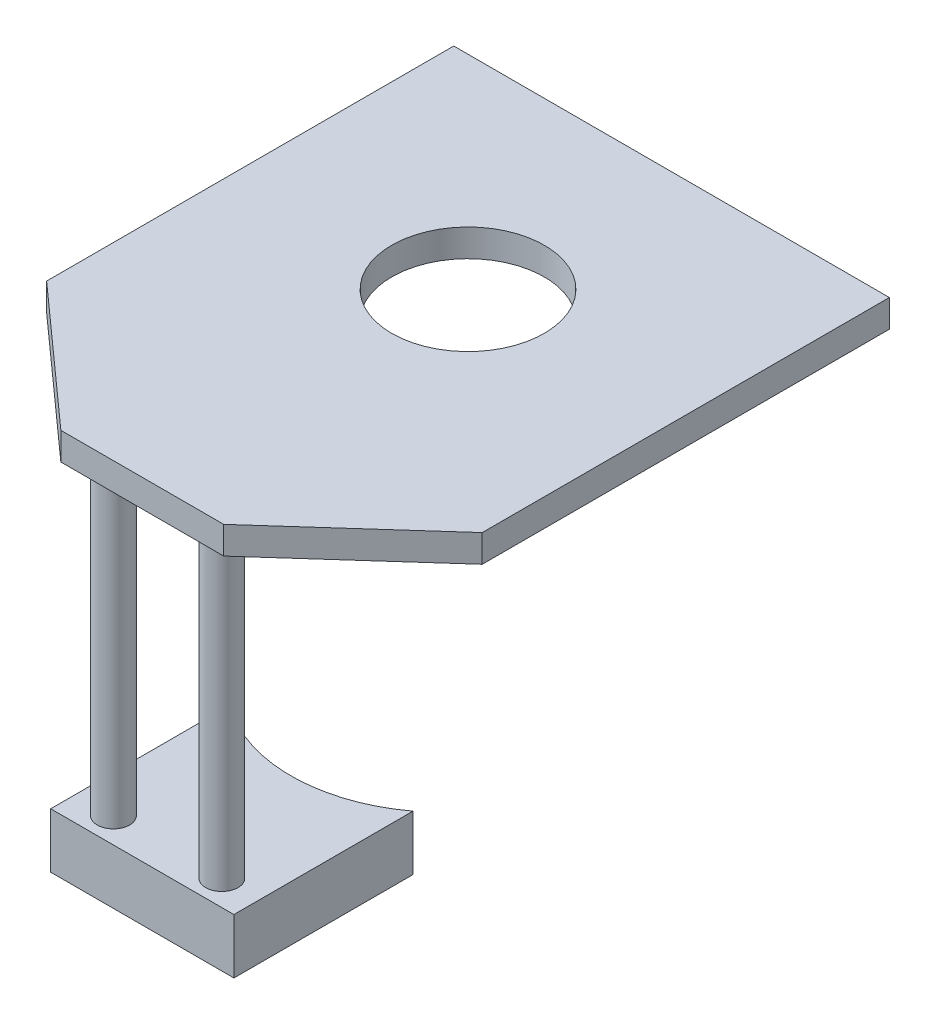
ISO-10303-21;
HEADER;
FILE_DESCRIPTION(('STEP AP214'),'2;1');
FILE_NAME('part.step','',(''),(''),'','','');
FILE_SCHEMA(('AUTOMOTIVE_DESIGN { 1 0 10303 214 1 1 1 1 }'));
ENDSEC;
DATA;
#1=APPLICATION_CONTEXT('core data for automotive mechanical design processes');
#2=APPLICATION_PROTOCOL_DEFINITION('international standard','automotive_design',2000,#1);
#3=PRODUCT_CONTEXT('',#1,'mechanical');
#4=PRODUCT('Part','Part','',(#3));
#5=PRODUCT_RELATED_PRODUCT_CATEGORY('part','',(#4));
#6=PRODUCT_DEFINITION_FORMATION('','',#4);
#7=PRODUCT_DEFINITION_CONTEXT('part definition',#1,'design');
#8=PRODUCT_DEFINITION('design','',#6,#7);
#9=PRODUCT_DEFINITION_SHAPE('','',#8);
#10=(LENGTH_UNIT() NAMED_UNIT(*) SI_UNIT(.MILLI.,.METRE.));
#11=(NAMED_UNIT(*) PLANE_ANGLE_UNIT() SI_UNIT($,.RADIAN.));
#12=(NAMED_UNIT(*) SI_UNIT($,.STERADIAN.) SOLID_ANGLE_UNIT());
#13=UNCERTAINTY_MEASURE_WITH_UNIT(LENGTH_MEASURE(1.E-05),#10,'distance_accuracy_value','');
#14=(GEOMETRIC_REPRESENTATION_CONTEXT(3) GLOBAL_UNCERTAINTY_ASSIGNED_CONTEXT((#13)) GLOBAL_UNIT_ASSIGNED_CONTEXT((#10,
#11,#12)) REPRESENTATION_CONTEXT('',''));
#15=CARTESIAN_POINT('',(0.,0.,0.));
#16=DIRECTION('',(0.,0.,1.));
#17=DIRECTION('',(1.,0.,0.));
#18=AXIS2_PLACEMENT_3D('',#15,#16,#17);
#19=CARTESIAN_POINT('',(0.,6.75,0.));
#20=DIRECTION('',(0.,-1.,0.));
#21=DIRECTION('',(0.,0.,-1.));
#22=AXIS2_PLACEMENT_3D('',#19,#20,#21);
#23=PLANE('',#22);
#24=DIRECTION('',(0.744950446844072,0.,-0.667119803143946));
#25=VECTOR('',#24,1.);
#26=CARTESIAN_POINT('',(40.,6.75,160.));
#27=LINE('',#26,#25);
#28=CARTESIAN_POINT('',(40.,6.75,160.));
#29=VERTEX_POINT('',#28);
#30=CARTESIAN_POINT('',(107.,6.75,100.));
#31=VERTEX_POINT('',#30);
#32=EDGE_CURVE('E142',#29,#31,#27,.T.);
#33=ORIENTED_EDGE('',*,*,#32,.T.);
#34=DIRECTION('',(0.,0.,-1.));
#35=VECTOR('',#34,1.);
#36=CARTESIAN_POINT('',(107.,6.75,-100.));
#37=LINE('',#36,#35);
#38=CARTESIAN_POINT('',(107.,6.75,-100.));
#39=VERTEX_POINT('',#38);
#40=EDGE_CURVE('E97',#31,#39,#37,.T.);
#41=ORIENTED_EDGE('',*,*,#40,.T.);
#42=DIRECTION('',(-1.,0.,0.));
#43=VECTOR('',#42,1.);
#44=CARTESIAN_POINT('',(-107.,6.75,-100.));
#45=LINE('',#44,#43);
#46=CARTESIAN_POINT('',(-107.,6.75,-100.));
#47=VERTEX_POINT('',#46);
#48=EDGE_CURVE('E113',#39,#47,#45,.T.);
#49=ORIENTED_EDGE('',*,*,#48,.T.);
#50=DIRECTION('',(0.,0.,1.));
#51=VECTOR('',#50,1.);
#52=CARTESIAN_POINT('',(-107.,6.75,-100.));
#53=LINE('',#52,#51);
#54=CARTESIAN_POINT('',(-107.,6.75,100.));
#55=VERTEX_POINT('',#54);
#56=EDGE_CURVE('E107',#47,#55,#53,.T.);
#57=ORIENTED_EDGE('',*,*,#56,.T.);
#58=DIRECTION('',(0.744950446844072,0.,0.667119803143946));
#59=VECTOR('',#58,1.);
#60=CARTESIAN_POINT('',(-107.,6.75,100.));
#61=LINE('',#60,#59);
#62=CARTESIAN_POINT('',(-40.,6.75,160.));
#63=VERTEX_POINT('',#62);
#64=EDGE_CURVE('E111',#55,#63,#61,.T.);
#65=ORIENTED_EDGE('',*,*,#64,.T.);
#66=DIRECTION('',(1.,0.,0.));
#67=VECTOR('',#66,1.);
#68=CARTESIAN_POINT('',(-40.,6.75,160.));
#69=LINE('',#68,#67);
#70=EDGE_CURVE('E59',#63,#29,#69,.T.);
#71=ORIENTED_EDGE('',*,*,#70,.T.);
#72=EDGE_LOOP('',(#33,#41,#49,#57,#65,#71));
#73=FACE_BOUND('',#72,.T.);
#74=CARTESIAN_POINT('',(0.,6.75,0.));
#75=DIRECTION('',(0.,1.,0.));
#76=DIRECTION('',(0.,0.,1.));
#77=AXIS2_PLACEMENT_3D('',#74,#75,#76);
#78=CIRCLE('',#77,37.5);
#79=CARTESIAN_POINT('',(0.,6.75,37.5));
#80=VERTEX_POINT('',#79);
#81=EDGE_CURVE('E135',#80,#80,#78,.T.);
#82=ORIENTED_EDGE('',*,*,#81,.F.);
#83=EDGE_LOOP('',(#82));
#84=FACE_BOUND('',#83,.T.);
#85=ADVANCED_FACE('F42',(#73,#84),#23,.F.);
#86=CARTESIAN_POINT('',(0.,-6.75,0.));
#87=DIRECTION('',(0.,-1.,0.));
#88=DIRECTION('',(0.,0.,-1.));
#89=AXIS2_PLACEMENT_3D('',#86,#87,#88);
#90=PLANE('',#89);
#91=CARTESIAN_POINT('',(26.625,-6.75,147.55));
#92=DIRECTION('',(0.,-1.,0.));
#93=DIRECTION('',(0.,0.,-1.));
#94=AXIS2_PLACEMENT_3D('',#91,#92,#93);
#95=CIRCLE('',#94,7.95000000000001);
#96=CARTESIAN_POINT('',(26.625,-6.75,139.6));
#97=VERTEX_POINT('',#96);
#98=EDGE_CURVE('E250',#97,#97,#95,.T.);
#99=ORIENTED_EDGE('',*,*,#98,.F.);
#100=EDGE_LOOP('',(#99));
#101=FACE_BOUND('',#100,.T.);
#102=CARTESIAN_POINT('',(-26.625,-6.75,147.55));
#103=DIRECTION('',(0.,-1.,0.));
#104=DIRECTION('',(0.,0.,-1.));
#105=AXIS2_PLACEMENT_3D('',#102,#103,#104);
#106=CIRCLE('',#105,7.95000000000001);
#107=CARTESIAN_POINT('',(-26.625,-6.75,139.6));
#108=VERTEX_POINT('',#107);
#109=EDGE_CURVE('E239',#108,#108,#106,.T.);
#110=ORIENTED_EDGE('',*,*,#109,.F.);
#111=EDGE_LOOP('',(#110));
#112=FACE_BOUND('',#111,.T.);
#113=DIRECTION('',(0.744950446844072,0.,-0.667119803143946));
#114=VECTOR('',#113,1.);
#115=CARTESIAN_POINT('',(40.,-6.75,160.));
#116=LINE('',#115,#114);
#117=CARTESIAN_POINT('',(40.,-6.75,160.));
#118=VERTEX_POINT('',#117);
#119=CARTESIAN_POINT('',(107.,-6.75,100.));
#120=VERTEX_POINT('',#119);
#121=EDGE_CURVE('E131',#118,#120,#116,.T.);
#122=ORIENTED_EDGE('',*,*,#121,.F.);
#123=DIRECTION('',(1.,0.,0.));
#124=VECTOR('',#123,1.);
#125=CARTESIAN_POINT('',(-40.,-6.75,160.));
#126=LINE('',#125,#124);
#127=CARTESIAN_POINT('',(-40.,-6.75,160.));
#128=VERTEX_POINT('',#127);
#129=EDGE_CURVE('E89',#128,#118,#126,.T.);
#130=ORIENTED_EDGE('',*,*,#129,.F.);
#131=DIRECTION('',(0.744950446844072,0.,0.667119803143946));
#132=VECTOR('',#131,1.);
#133=CARTESIAN_POINT('',(-107.,-6.75,100.));
#134=LINE('',#133,#132);
#135=CARTESIAN_POINT('',(-107.,-6.75,100.));
#136=VERTEX_POINT('',#135);
#137=EDGE_CURVE('E83',#136,#128,#134,.T.);
#138=ORIENTED_EDGE('',*,*,#137,.F.);
#139=DIRECTION('',(0.,0.,1.));
#140=VECTOR('',#139,1.);
#141=CARTESIAN_POINT('',(-107.,-6.75,-100.));
#142=LINE('',#141,#140);
#143=CARTESIAN_POINT('',(-107.,-6.75,-100.));
#144=VERTEX_POINT('',#143);
#145=EDGE_CURVE('E121',#144,#136,#142,.T.);
#146=ORIENTED_EDGE('',*,*,#145,.F.);
#147=DIRECTION('',(-1.,0.,0.));
#148=VECTOR('',#147,1.);
#149=CARTESIAN_POINT('',(-107.,-6.75,-100.));
#150=LINE('',#149,#148);
#151=CARTESIAN_POINT('',(107.,-6.75,-100.));
#152=VERTEX_POINT('',#151);
#153=EDGE_CURVE('E137',#152,#144,#150,.T.);
#154=ORIENTED_EDGE('',*,*,#153,.F.);
#155=DIRECTION('',(0.,0.,-1.));
#156=VECTOR('',#155,1.);
#157=CARTESIAN_POINT('',(107.,-6.75,-100.));
#158=LINE('',#157,#156);
#159=EDGE_CURVE('E134',#120,#152,#158,.T.);
#160=ORIENTED_EDGE('',*,*,#159,.F.);
#161=EDGE_LOOP('',(#122,#130,#138,#146,#154,#160));
#162=FACE_BOUND('',#161,.T.);
#163=CARTESIAN_POINT('',(0.,-6.75,0.));
#164=DIRECTION('',(0.,1.,0.));
#165=DIRECTION('',(0.,0.,1.));
#166=AXIS2_PLACEMENT_3D('',#163,#164,#165);
#167=CIRCLE('',#166,37.5);
#168=CARTESIAN_POINT('',(0.,-6.75,37.5));
#169=VERTEX_POINT('',#168);
#170=EDGE_CURVE('E249',#169,#169,#167,.T.);
#171=ORIENTED_EDGE('',*,*,#170,.T.);
#172=EDGE_LOOP('',(#171));
#173=FACE_BOUND('',#172,.T.);
#174=ADVANCED_FACE('F151',(#101,#112,#162,#173),#90,.T.);
#175=CARTESIAN_POINT('',(40.,6.75,160.));
#176=DIRECTION('',(-0.667119803143946,0.,-0.744950446844072));
#177=DIRECTION('',(-0.744950446844073,0.,0.667119803143946));
#178=AXIS2_PLACEMENT_3D('',#175,#176,#177);
#179=PLANE('',#178);
#180=ORIENTED_EDGE('',*,*,#121,.T.);
#181=DIRECTION('',(0.,-1.,0.));
#182=VECTOR('',#181,1.);
#183=CARTESIAN_POINT('',(107.,6.75,100.));
#184=LINE('',#183,#182);
#185=EDGE_CURVE('E11',#31,#120,#184,.T.);
#186=ORIENTED_EDGE('',*,*,#185,.F.);
#187=ORIENTED_EDGE('',*,*,#32,.F.);
#188=DIRECTION('',(0.,-1.,0.));
#189=VECTOR('',#188,1.);
#190=CARTESIAN_POINT('',(40.,6.75,160.));
#191=LINE('',#190,#189);
#192=EDGE_CURVE('E127',#29,#118,#191,.T.);
#193=ORIENTED_EDGE('',*,*,#192,.T.);
#194=EDGE_LOOP('',(#180,#186,#187,#193));
#195=FACE_BOUND('',#194,.T.);
#196=ADVANCED_FACE('F44',(#195),#179,.F.);
#197=CARTESIAN_POINT('',(107.,6.75,-100.));
#198=DIRECTION('',(-1.,0.,0.));
#199=DIRECTION('',(0.,0.,1.));
#200=AXIS2_PLACEMENT_3D('',#197,#198,#199);
#201=PLANE('',#200);
#202=ORIENTED_EDGE('',*,*,#159,.T.);
#203=DIRECTION('',(0.,-1.,0.));
#204=VECTOR('',#203,1.);
#205=CARTESIAN_POINT('',(107.,6.75,-100.));
#206=LINE('',#205,#204);
#207=EDGE_CURVE('E51',#39,#152,#206,.T.);
#208=ORIENTED_EDGE('',*,*,#207,.F.);
#209=ORIENTED_EDGE('',*,*,#40,.F.);
#210=ORIENTED_EDGE('',*,*,#185,.T.);
#211=EDGE_LOOP('',(#202,#208,#209,#210));
#212=FACE_BOUND('',#211,.T.);
#213=ADVANCED_FACE('F369',(#212),#201,.F.);
#214=CARTESIAN_POINT('',(-107.,6.75,-100.));
#215=DIRECTION('',(0.,0.,1.));
#216=DIRECTION('',(1.,0.,0.));
#217=AXIS2_PLACEMENT_3D('',#214,#215,#216);
#218=PLANE('',#217);
#219=ORIENTED_EDGE('',*,*,#153,.T.);
#220=DIRECTION('',(0.,-1.,0.));
#221=VECTOR('',#220,1.);
#222=CARTESIAN_POINT('',(-107.,6.75,-100.));
#223=LINE('',#222,#221);
#224=EDGE_CURVE('E122',#47,#144,#223,.T.);
#225=ORIENTED_EDGE('',*,*,#224,.F.);
#226=ORIENTED_EDGE('',*,*,#48,.F.);
#227=ORIENTED_EDGE('',*,*,#207,.T.);
#228=EDGE_LOOP('',(#219,#225,#226,#227));
#229=FACE_BOUND('',#228,.T.);
#230=ADVANCED_FACE('F148',(#229),#218,.F.);
#231=CARTESIAN_POINT('',(-107.,6.75,-100.));
#232=DIRECTION('',(1.,0.,0.));
#233=DIRECTION('',(0.,0.,-1.));
#234=AXIS2_PLACEMENT_3D('',#231,#232,#233);
#235=PLANE('',#234);
#236=ORIENTED_EDGE('',*,*,#145,.T.);
#237=DIRECTION('',(0.,-1.,0.));
#238=VECTOR('',#237,1.);
#239=CARTESIAN_POINT('',(-107.,6.75,100.));
#240=LINE('',#239,#238);
#241=EDGE_CURVE('E118',#55,#136,#240,.T.);
#242=ORIENTED_EDGE('',*,*,#241,.F.);
#243=ORIENTED_EDGE('',*,*,#56,.F.);
#244=ORIENTED_EDGE('',*,*,#224,.T.);
#245=EDGE_LOOP('',(#236,#242,#243,#244));
#246=FACE_BOUND('',#245,.T.);
#247=ADVANCED_FACE('F119',(#246),#235,.F.);
#248=CARTESIAN_POINT('',(-107.,6.75,100.));
#249=DIRECTION('',(0.667119803143946,0.,-0.744950446844072));
#250=DIRECTION('',(-0.744950446844072,0.,-0.667119803143946));
#251=AXIS2_PLACEMENT_3D('',#248,#249,#250);
#252=PLANE('',#251);
#253=ORIENTED_EDGE('',*,*,#137,.T.);
#254=DIRECTION('',(0.,-1.,0.));
#255=VECTOR('',#254,1.);
#256=CARTESIAN_POINT('',(-40.,6.75,160.));
#257=LINE('',#256,#255);
#258=EDGE_CURVE('E123',#63,#128,#257,.T.);
#259=ORIENTED_EDGE('',*,*,#258,.F.);
#260=ORIENTED_EDGE('',*,*,#64,.F.);
#261=ORIENTED_EDGE('',*,*,#241,.T.);
#262=EDGE_LOOP('',(#253,#259,#260,#261));
#263=FACE_BOUND('',#262,.T.);
#264=ADVANCED_FACE('F125',(#263),#252,.F.);
#265=CARTESIAN_POINT('',(-40.,6.75,160.));
#266=DIRECTION('',(0.,0.,-1.));
#267=DIRECTION('',(-1.,0.,0.));
#268=AXIS2_PLACEMENT_3D('',#265,#266,#267);
#269=PLANE('',#268);
#270=ORIENTED_EDGE('',*,*,#129,.T.);
#271=ORIENTED_EDGE('',*,*,#192,.F.);
#272=ORIENTED_EDGE('',*,*,#70,.F.);
#273=ORIENTED_EDGE('',*,*,#258,.T.);
#274=EDGE_LOOP('',(#270,#271,#272,#273));
#275=FACE_BOUND('',#274,.T.);
#276=ADVANCED_FACE('F156',(#275),#269,.F.);
#277=CARTESIAN_POINT('',(0.,6.75,0.));
#278=DIRECTION('',(0.,-1.,0.));
#279=DIRECTION('',(0.,0.,-1.));
#280=AXIS2_PLACEMENT_3D('',#277,#278,#279);
#281=CYLINDRICAL_SURFACE('',#280,37.5);
#282=ORIENTED_EDGE('',*,*,#81,.T.);
#283=EDGE_LOOP('',(#282));
#284=FACE_BOUND('',#283,.T.);
#285=ORIENTED_EDGE('',*,*,#170,.F.);
#286=EDGE_LOOP('',(#285));
#287=FACE_BOUND('',#286,.T.);
#288=ADVANCED_FACE('F158',(#284,#287),#281,.F.);
#289=CARTESIAN_POINT('',(-26.625,-156.75,147.55));
#290=DIRECTION('',(0.,1.,0.));
#291=DIRECTION('',(0.,0.,1.));
#292=AXIS2_PLACEMENT_3D('',#289,#290,#291);
#293=CYLINDRICAL_SURFACE('',#292,7.95000000000001);
#294=CARTESIAN_POINT('',(-26.625,-156.75,147.55));
#295=DIRECTION('',(0.,-1.,0.));
#296=DIRECTION('',(0.,0.,-1.));
#297=AXIS2_PLACEMENT_3D('',#294,#295,#296);
#298=CIRCLE('',#297,7.95000000000001);
#299=CARTESIAN_POINT('',(-26.625,-156.75,139.6));
#300=VERTEX_POINT('',#299);
#301=EDGE_CURVE('E235',#300,#300,#298,.T.);
#302=ORIENTED_EDGE('',*,*,#301,.F.);
#303=EDGE_LOOP('',(#302));
#304=FACE_BOUND('',#303,.T.);
#305=ORIENTED_EDGE('',*,*,#109,.T.);
#306=EDGE_LOOP('',(#305));
#307=FACE_BOUND('',#306,.T.);
#308=ADVANCED_FACE('F164',(#304,#307),#293,.T.);
#309=CARTESIAN_POINT('',(26.625,-156.75,147.55));
#310=DIRECTION('',(0.,1.,0.));
#311=DIRECTION('',(0.,0.,1.));
#312=AXIS2_PLACEMENT_3D('',#309,#310,#311);
#313=CYLINDRICAL_SURFACE('',#312,7.95000000000001);
#314=CARTESIAN_POINT('',(26.625,-156.75,147.55));
#315=DIRECTION('',(0.,-1.,0.));
#316=DIRECTION('',(0.,0.,-1.));
#317=AXIS2_PLACEMENT_3D('',#314,#315,#316);
#318=CIRCLE('',#317,7.95000000000001);
#319=CARTESIAN_POINT('',(26.625,-156.75,139.6));
#320=VERTEX_POINT('',#319);
#321=EDGE_CURVE('E246',#320,#320,#318,.T.);
#322=ORIENTED_EDGE('',*,*,#321,.F.);
#323=EDGE_LOOP('',(#322));
#324=FACE_BOUND('',#323,.T.);
#325=ORIENTED_EDGE('',*,*,#98,.T.);
#326=EDGE_LOOP('',(#325));
#327=FACE_BOUND('',#326,.T.);
#328=ADVANCED_FACE('F179',(#324,#327),#313,.T.);
#329=CARTESIAN_POINT('',(45.,-183.75,72.));
#330=DIRECTION('',(-1.,0.,0.));
#331=DIRECTION('',(0.,0.,1.));
#332=AXIS2_PLACEMENT_3D('',#329,#330,#331);
#333=PLANE('',#332);
#334=DIRECTION('',(0.,0.,1.));
#335=VECTOR('',#334,1.);
#336=CARTESIAN_POINT('',(45.,-156.75,72.));
#337=LINE('',#336,#335);
#338=CARTESIAN_POINT('',(45.,-156.75,72.));
#339=VERTEX_POINT('',#338);
#340=CARTESIAN_POINT('',(45.,-156.75,160.));
#341=VERTEX_POINT('',#340);
#342=EDGE_CURVE('E233',#339,#341,#337,.T.);
#343=ORIENTED_EDGE('',*,*,#342,.T.);
#344=DIRECTION('',(0.,1.,0.));
#345=VECTOR('',#344,1.);
#346=CARTESIAN_POINT('',(45.,-183.75,160.));
#347=LINE('',#346,#345);
#348=CARTESIAN_POINT('',(45.,-183.75,160.));
#349=VERTEX_POINT('',#348);
#350=EDGE_CURVE('E230',#349,#341,#347,.T.);
#351=ORIENTED_EDGE('',*,*,#350,.F.);
#352=DIRECTION('',(0.,0.,1.));
#353=VECTOR('',#352,1.);
#354=CARTESIAN_POINT('',(45.,-183.75,72.));
#355=LINE('',#354,#353);
#356=CARTESIAN_POINT('',(45.,-183.75,72.));
#357=VERTEX_POINT('',#356);
#358=EDGE_CURVE('E214',#357,#349,#355,.T.);
#359=ORIENTED_EDGE('',*,*,#358,.F.);
#360=DIRECTION('',(0.,1.,0.));
#361=VECTOR('',#360,1.);
#362=CARTESIAN_POINT('',(45.,-183.75,72.));
#363=LINE('',#362,#361);
#364=EDGE_CURVE('E286',#357,#339,#363,.T.);
#365=ORIENTED_EDGE('',*,*,#364,.T.);
#366=EDGE_LOOP('',(#343,#351,#359,#365));
#367=FACE_BOUND('',#366,.T.);
#368=ADVANCED_FACE('F183',(#367),#333,.F.);
#369=CARTESIAN_POINT('',(-45.,-183.75,160.));
#370=DIRECTION('',(0.,0.,-1.));
#371=DIRECTION('',(-1.,0.,0.));
#372=AXIS2_PLACEMENT_3D('',#369,#370,#371);
#373=PLANE('',#372);
#374=DIRECTION('',(-1.,0.,0.));
#375=VECTOR('',#374,1.);
#376=CARTESIAN_POINT('',(-45.,-156.75,160.));
#377=LINE('',#376,#375);
#378=CARTESIAN_POINT('',(-45.,-156.75,160.));
#379=VERTEX_POINT('',#378);
#380=EDGE_CURVE('E276',#341,#379,#377,.T.);
#381=ORIENTED_EDGE('',*,*,#380,.T.);
#382=DIRECTION('',(0.,1.,0.));
#383=VECTOR('',#382,1.);
#384=CARTESIAN_POINT('',(-45.,-183.75,160.));
#385=LINE('',#384,#383);
#386=CARTESIAN_POINT('',(-45.,-183.75,160.));
#387=VERTEX_POINT('',#386);
#388=EDGE_CURVE('E236',#387,#379,#385,.T.);
#389=ORIENTED_EDGE('',*,*,#388,.F.);
#390=DIRECTION('',(-1.,0.,0.));
#391=VECTOR('',#390,1.);
#392=CARTESIAN_POINT('',(-45.,-183.75,160.));
#393=LINE('',#392,#391);
#394=EDGE_CURVE('E219',#349,#387,#393,.T.);
#395=ORIENTED_EDGE('',*,*,#394,.F.);
#396=ORIENTED_EDGE('',*,*,#350,.T.);
#397=EDGE_LOOP('',(#381,#389,#395,#396));
#398=FACE_BOUND('',#397,.T.);
#399=ADVANCED_FACE('F187',(#398),#373,.F.);
#400=CARTESIAN_POINT('',(-45.,-183.75,72.));
#401=DIRECTION('',(1.,0.,0.));
#402=DIRECTION('',(0.,0.,-1.));
#403=AXIS2_PLACEMENT_3D('',#400,#401,#402);
#404=PLANE('',#403);
#405=DIRECTION('',(0.,0.,-1.));
#406=VECTOR('',#405,1.);
#407=CARTESIAN_POINT('',(-45.,-156.75,72.));
#408=LINE('',#407,#406);
#409=CARTESIAN_POINT('',(-45.,-156.75,72.));
#410=VERTEX_POINT('',#409);
#411=EDGE_CURVE('E278',#379,#410,#408,.T.);
#412=ORIENTED_EDGE('',*,*,#411,.T.);
#413=DIRECTION('',(0.,1.,0.));
#414=VECTOR('',#413,1.);
#415=CARTESIAN_POINT('',(-45.,-183.75,72.));
#416=LINE('',#415,#414);
#417=CARTESIAN_POINT('',(-45.,-183.75,72.));
#418=VERTEX_POINT('',#417);
#419=EDGE_CURVE('E242',#418,#410,#416,.T.);
#420=ORIENTED_EDGE('',*,*,#419,.F.);
#421=DIRECTION('',(0.,0.,-1.));
#422=VECTOR('',#421,1.);
#423=CARTESIAN_POINT('',(-45.,-183.75,72.));
#424=LINE('',#423,#422);
#425=EDGE_CURVE('E292',#387,#418,#424,.T.);
#426=ORIENTED_EDGE('',*,*,#425,.F.);
#427=ORIENTED_EDGE('',*,*,#388,.T.);
#428=EDGE_LOOP('',(#412,#420,#426,#427));
#429=FACE_BOUND('',#428,.T.);
#430=ADVANCED_FACE('F191',(#429),#404,.F.);
#431=CARTESIAN_POINT('',(0.,-183.75,12.));
#432=DIRECTION('',(0.,1.,0.));
#433=DIRECTION('',(0.,0.,1.));
#434=AXIS2_PLACEMENT_3D('',#431,#432,#433);
#435=CYLINDRICAL_SURFACE('',#434,75.);
#436=CARTESIAN_POINT('',(0.,-156.75,12.));
#437=DIRECTION('',(0.,1.,0.));
#438=DIRECTION('',(0.,0.,-1.));
#439=AXIS2_PLACEMENT_3D('',#436,#437,#438);
#440=CIRCLE('',#439,75.);
#441=EDGE_CURVE('E226',#410,#339,#440,.T.);
#442=ORIENTED_EDGE('',*,*,#441,.T.);
#443=ORIENTED_EDGE('',*,*,#364,.F.);
#444=CARTESIAN_POINT('',(0.,-183.75,12.));
#445=DIRECTION('',(0.,1.,0.));
#446=DIRECTION('',(0.,0.,-1.));
#447=AXIS2_PLACEMENT_3D('',#444,#445,#446);
#448=CIRCLE('',#447,75.);
#449=EDGE_CURVE('E222',#418,#357,#448,.T.);
#450=ORIENTED_EDGE('',*,*,#449,.F.);
#451=ORIENTED_EDGE('',*,*,#419,.T.);
#452=EDGE_LOOP('',(#442,#443,#450,#451));
#453=FACE_BOUND('',#452,.T.);
#454=ADVANCED_FACE('F195',(#453),#435,.F.);
#455=CARTESIAN_POINT('',(0.,-183.75,12.));
#456=DIRECTION('',(0.,-1.,0.));
#457=DIRECTION('',(0.,0.,-1.));
#458=AXIS2_PLACEMENT_3D('',#455,#456,#457);
#459=PLANE('',#458);
#460=ORIENTED_EDGE('',*,*,#358,.T.);
#461=ORIENTED_EDGE('',*,*,#394,.T.);
#462=ORIENTED_EDGE('',*,*,#425,.T.);
#463=ORIENTED_EDGE('',*,*,#449,.T.);
#464=EDGE_LOOP('',(#460,#461,#462,#463));
#465=FACE_BOUND('',#464,.T.);
#466=ADVANCED_FACE('F199',(#465),#459,.T.);
#467=CARTESIAN_POINT('',(0.,-156.75,12.));
#468=DIRECTION('',(0.,-1.,0.));
#469=DIRECTION('',(0.,0.,-1.));
#470=AXIS2_PLACEMENT_3D('',#467,#468,#469);
#471=PLANE('',#470);
#472=ORIENTED_EDGE('',*,*,#301,.T.);
#473=EDGE_LOOP('',(#472));
#474=FACE_BOUND('',#473,.T.);
#475=ORIENTED_EDGE('',*,*,#321,.T.);
#476=EDGE_LOOP('',(#475));
#477=FACE_BOUND('',#476,.T.);
#478=ORIENTED_EDGE('',*,*,#342,.F.);
#479=ORIENTED_EDGE('',*,*,#441,.F.);
#480=ORIENTED_EDGE('',*,*,#411,.F.);
#481=ORIENTED_EDGE('',*,*,#380,.F.);
#482=EDGE_LOOP('',(#478,#479,#480,#481));
#483=FACE_BOUND('',#482,.T.);
#484=ADVANCED_FACE('F201',(#474,#477,#483),#471,.F.);
#485=CLOSED_SHELL('',(#85,#174,#196,#213,#230,#247,#264,#276,#288,#308,#328,#368,#399,#430,#454,
#466,#484));
#486=MANIFOLD_SOLID_BREP('B2',#485);
#487=ADVANCED_BREP_SHAPE_REPRESENTATION('',(#18,#486),#14);
#488=SHAPE_DEFINITION_REPRESENTATION(#9,#487);
ENDSEC;
END-ISO-10303-21;
